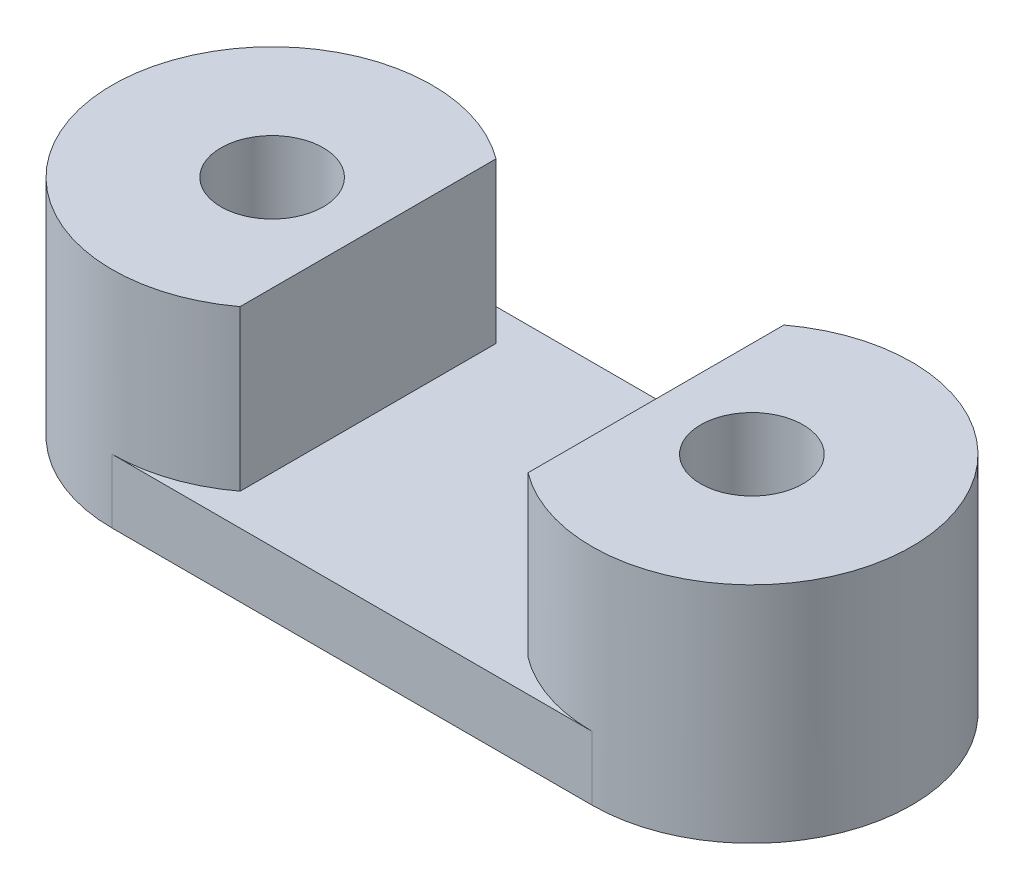
ISO-10303-21;
HEADER;
FILE_DESCRIPTION(('STEP AP214'),'2;1');
FILE_NAME('part.step','',(''),(''),'','','');
FILE_SCHEMA(('AUTOMOTIVE_DESIGN { 1 0 10303 214 1 1 1 1 }'));
ENDSEC;
DATA;
#1=APPLICATION_CONTEXT('core data for automotive mechanical design processes');
#2=APPLICATION_PROTOCOL_DEFINITION('international standard','automotive_design',2000,#1);
#3=PRODUCT_CONTEXT('',#1,'mechanical');
#4=PRODUCT('Part','Part','',(#3));
#5=PRODUCT_RELATED_PRODUCT_CATEGORY('part','',(#4));
#6=PRODUCT_DEFINITION_FORMATION('','',#4);
#7=PRODUCT_DEFINITION_CONTEXT('part definition',#1,'design');
#8=PRODUCT_DEFINITION('design','',#6,#7);
#9=PRODUCT_DEFINITION_SHAPE('','',#8);
#10=(LENGTH_UNIT() NAMED_UNIT(*) SI_UNIT(.MILLI.,.METRE.));
#11=(NAMED_UNIT(*) PLANE_ANGLE_UNIT() SI_UNIT($,.RADIAN.));
#12=(NAMED_UNIT(*) SI_UNIT($,.STERADIAN.) SOLID_ANGLE_UNIT());
#13=UNCERTAINTY_MEASURE_WITH_UNIT(LENGTH_MEASURE(1.E-05),#10,'distance_accuracy_value','');
#14=(GEOMETRIC_REPRESENTATION_CONTEXT(3) GLOBAL_UNCERTAINTY_ASSIGNED_CONTEXT((#13)) GLOBAL_UNIT_ASSIGNED_CONTEXT((#10,
#11,#12)) REPRESENTATION_CONTEXT('',''));
#15=CARTESIAN_POINT('',(0.,0.,0.));
#16=DIRECTION('',(0.,0.,1.));
#17=DIRECTION('',(1.,0.,0.));
#18=AXIS2_PLACEMENT_3D('',#15,#16,#17);
#19=CARTESIAN_POINT('',(-7.5,2.,0.));
#20=DIRECTION('',(0.,1.,0.));
#21=DIRECTION('',(0.,0.,1.));
#22=AXIS2_PLACEMENT_3D('',#19,#20,#21);
#23=PLANE('',#22);
#24=DIRECTION('',(-1.,0.,0.));
#25=VECTOR('',#24,1.);
#26=CARTESIAN_POINT('',(-7.5,2.,-5.));
#27=LINE('',#26,#25);
#28=CARTESIAN_POINT('',(7.5,2.,-5.));
#29=VERTEX_POINT('',#28);
#30=CARTESIAN_POINT('',(-7.5,2.,-5.));
#31=VERTEX_POINT('',#30);
#32=EDGE_CURVE('E147',#29,#31,#27,.T.);
#33=ORIENTED_EDGE('',*,*,#32,.T.);
#34=CARTESIAN_POINT('',(-7.5,2.,0.));
#35=DIRECTION('',(0.,1.,0.));
#36=DIRECTION('',(0.,0.,1.));
#37=AXIS2_PLACEMENT_3D('',#34,#35,#36);
#38=CIRCLE('',#37,5.);
#39=CARTESIAN_POINT('',(-4.5,2.,-4.));
#40=VERTEX_POINT('',#39);
#41=EDGE_CURVE('E36',#40,#31,#38,.T.);
#42=ORIENTED_EDGE('',*,*,#41,.F.);
#43=DIRECTION('',(0.,0.,1.));
#44=VECTOR('',#43,1.);
#45=CARTESIAN_POINT('',(-4.5,2.,-5.00005));
#46=LINE('',#45,#44);
#47=CARTESIAN_POINT('',(-4.5,2.,4.));
#48=VERTEX_POINT('',#47);
#49=EDGE_CURVE('E111',#40,#48,#46,.T.);
#50=ORIENTED_EDGE('',*,*,#49,.T.);
#51=CARTESIAN_POINT('',(-7.5,2.,5.));
#52=VERTEX_POINT('',#51);
#53=EDGE_CURVE('E130',#52,#48,#38,.T.);
#54=ORIENTED_EDGE('',*,*,#53,.F.);
#55=DIRECTION('',(1.,0.,0.));
#56=VECTOR('',#55,1.);
#57=CARTESIAN_POINT('',(-7.5,2.,5.));
#58=LINE('',#57,#56);
#59=CARTESIAN_POINT('',(7.5,2.,5.));
#60=VERTEX_POINT('',#59);
#61=EDGE_CURVE('E145',#52,#60,#58,.T.);
#62=ORIENTED_EDGE('',*,*,#61,.T.);
#63=CARTESIAN_POINT('',(7.5,2.,0.));
#64=DIRECTION('',(0.,1.,0.));
#65=DIRECTION('',(0.,0.,1.));
#66=AXIS2_PLACEMENT_3D('',#63,#64,#65);
#67=CIRCLE('',#66,5.);
#68=CARTESIAN_POINT('',(4.5,2.,4.));
#69=VERTEX_POINT('',#68);
#70=EDGE_CURVE('E110',#69,#60,#67,.T.);
#71=ORIENTED_EDGE('',*,*,#70,.F.);
#72=DIRECTION('',(0.,0.,1.));
#73=VECTOR('',#72,1.);
#74=CARTESIAN_POINT('',(4.5,2.,-5.00005));
#75=LINE('',#74,#73);
#76=CARTESIAN_POINT('',(4.5,2.,-4.));
#77=VERTEX_POINT('',#76);
#78=EDGE_CURVE('E99',#77,#69,#75,.T.);
#79=ORIENTED_EDGE('',*,*,#78,.F.);
#80=EDGE_CURVE('E108',#29,#77,#67,.T.);
#81=ORIENTED_EDGE('',*,*,#80,.F.);
#82=EDGE_LOOP('',(#33,#42,#50,#54,#62,#71,#79,#81));
#83=FACE_BOUND('',#82,.T.);
#84=ADVANCED_FACE('F32',(#83),#23,.T.);
#85=CARTESIAN_POINT('',(-7.5,0.,0.));
#86=DIRECTION('',(0.,1.,0.));
#87=DIRECTION('',(0.,0.,1.));
#88=AXIS2_PLACEMENT_3D('',#85,#86,#87);
#89=PLANE('',#88);
#90=CARTESIAN_POINT('',(-7.5,0.,0.));
#91=DIRECTION('',(0.,1.,0.));
#92=DIRECTION('',(0.,0.,1.));
#93=AXIS2_PLACEMENT_3D('',#90,#91,#92);
#94=CIRCLE('',#93,1.6);
#95=CARTESIAN_POINT('',(-7.5,0.,1.6));
#96=VERTEX_POINT('',#95);
#97=EDGE_CURVE('E174',#96,#96,#94,.T.);
#98=ORIENTED_EDGE('',*,*,#97,.T.);
#99=EDGE_LOOP('',(#98));
#100=FACE_BOUND('',#99,.T.);
#101=CARTESIAN_POINT('',(-7.5,0.,0.));
#102=DIRECTION('',(0.,1.,0.));
#103=DIRECTION('',(0.,0.,1.));
#104=AXIS2_PLACEMENT_3D('',#101,#102,#103);
#105=CIRCLE('',#104,5.);
#106=CARTESIAN_POINT('',(-7.5,0.,-5.));
#107=VERTEX_POINT('',#106);
#108=CARTESIAN_POINT('',(-7.5,0.,5.));
#109=VERTEX_POINT('',#108);
#110=EDGE_CURVE('E173',#107,#109,#105,.T.);
#111=ORIENTED_EDGE('',*,*,#110,.F.);
#112=DIRECTION('',(-1.,0.,0.));
#113=VECTOR('',#112,1.);
#114=CARTESIAN_POINT('',(-7.5,0.,-5.));
#115=LINE('',#114,#113);
#116=CARTESIAN_POINT('',(7.5,0.,-5.));
#117=VERTEX_POINT('',#116);
#118=EDGE_CURVE('E148',#117,#107,#115,.T.);
#119=ORIENTED_EDGE('',*,*,#118,.F.);
#120=CARTESIAN_POINT('',(7.5,0.,0.));
#121=DIRECTION('',(0.,1.,0.));
#122=DIRECTION('',(0.,0.,1.));
#123=AXIS2_PLACEMENT_3D('',#120,#121,#122);
#124=CIRCLE('',#123,5.);
#125=CARTESIAN_POINT('',(7.5,0.,5.));
#126=VERTEX_POINT('',#125);
#127=EDGE_CURVE('E169',#126,#117,#124,.T.);
#128=ORIENTED_EDGE('',*,*,#127,.F.);
#129=DIRECTION('',(1.,0.,0.));
#130=VECTOR('',#129,1.);
#131=CARTESIAN_POINT('',(-7.5,0.,5.));
#132=LINE('',#131,#130);
#133=EDGE_CURVE('E171',#109,#126,#132,.T.);
#134=ORIENTED_EDGE('',*,*,#133,.F.);
#135=EDGE_LOOP('',(#111,#119,#128,#134));
#136=FACE_BOUND('',#135,.T.);
#137=CARTESIAN_POINT('',(7.5,0.,0.));
#138=DIRECTION('',(0.,1.,0.));
#139=DIRECTION('',(0.,0.,1.));
#140=AXIS2_PLACEMENT_3D('',#137,#138,#139);
#141=CIRCLE('',#140,1.6);
#142=CARTESIAN_POINT('',(7.5,0.,1.6));
#143=VERTEX_POINT('',#142);
#144=EDGE_CURVE('E129',#143,#143,#141,.T.);
#145=ORIENTED_EDGE('',*,*,#144,.T.);
#146=EDGE_LOOP('',(#145));
#147=FACE_BOUND('',#146,.T.);
#148=ADVANCED_FACE('F181',(#100,#136,#147),#89,.F.);
#149=CARTESIAN_POINT('',(-7.5,2.,0.));
#150=DIRECTION('',(0.,-1.,0.));
#151=DIRECTION('',(0.,0.,-1.));
#152=AXIS2_PLACEMENT_3D('',#149,#150,#151);
#153=CYLINDRICAL_SURFACE('',#152,5.);
#154=CARTESIAN_POINT('',(-7.5,7.,0.));
#155=DIRECTION('',(0.,1.,0.));
#156=DIRECTION('',(0.,0.,1.));
#157=AXIS2_PLACEMENT_3D('',#154,#155,#156);
#158=CIRCLE('',#157,5.);
#159=CARTESIAN_POINT('',(-4.5,7.,-4.));
#160=VERTEX_POINT('',#159);
#161=CARTESIAN_POINT('',(-4.5,7.,4.));
#162=VERTEX_POINT('',#161);
#163=EDGE_CURVE('E126',#160,#162,#158,.T.);
#164=ORIENTED_EDGE('',*,*,#163,.F.);
#165=DIRECTION('',(0.,-1.,0.));
#166=VECTOR('',#165,1.);
#167=CARTESIAN_POINT('',(-4.5,2.,-4.));
#168=LINE('',#167,#166);
#169=EDGE_CURVE('E48',#160,#40,#168,.T.);
#170=ORIENTED_EDGE('',*,*,#169,.T.);
#171=ORIENTED_EDGE('',*,*,#41,.T.);
#172=DIRECTION('',(0.,-1.,0.));
#173=VECTOR('',#172,1.);
#174=CARTESIAN_POINT('',(-7.5,2.,-5.));
#175=LINE('',#174,#173);
#176=EDGE_CURVE('E152',#31,#107,#175,.T.);
#177=ORIENTED_EDGE('',*,*,#176,.T.);
#178=ORIENTED_EDGE('',*,*,#110,.T.);
#179=DIRECTION('',(0.,-1.,0.));
#180=VECTOR('',#179,1.);
#181=CARTESIAN_POINT('',(-7.5,2.,5.));
#182=LINE('',#181,#180);
#183=EDGE_CURVE('E139',#52,#109,#182,.T.);
#184=ORIENTED_EDGE('',*,*,#183,.F.);
#185=ORIENTED_EDGE('',*,*,#53,.T.);
#186=DIRECTION('',(0.,-1.,0.));
#187=VECTOR('',#186,1.);
#188=CARTESIAN_POINT('',(-4.5,2.,4.));
#189=LINE('',#188,#187);
#190=EDGE_CURVE('E192',#48,#162,#189,.F.);
#191=ORIENTED_EDGE('',*,*,#190,.T.);
#192=EDGE_LOOP('',(#164,#170,#171,#177,#178,#184,#185,#191));
#193=FACE_BOUND('',#192,.T.);
#194=ADVANCED_FACE('F34',(#193),#153,.T.);
#195=CARTESIAN_POINT('',(-7.5,2.,5.));
#196=DIRECTION('',(0.,0.,-1.));
#197=DIRECTION('',(-1.,0.,0.));
#198=AXIS2_PLACEMENT_3D('',#195,#196,#197);
#199=PLANE('',#198);
#200=ORIENTED_EDGE('',*,*,#133,.T.);
#201=DIRECTION('',(0.,-1.,0.));
#202=VECTOR('',#201,1.);
#203=CARTESIAN_POINT('',(7.5,2.,5.));
#204=LINE('',#203,#202);
#205=EDGE_CURVE('E137',#60,#126,#204,.T.);
#206=ORIENTED_EDGE('',*,*,#205,.F.);
#207=ORIENTED_EDGE('',*,*,#61,.F.);
#208=ORIENTED_EDGE('',*,*,#183,.T.);
#209=EDGE_LOOP('',(#200,#206,#207,#208));
#210=FACE_BOUND('',#209,.T.);
#211=ADVANCED_FACE('F205',(#210),#199,.F.);
#212=CARTESIAN_POINT('',(7.5,2.,0.));
#213=DIRECTION('',(0.,-1.,0.));
#214=DIRECTION('',(0.,0.,-1.));
#215=AXIS2_PLACEMENT_3D('',#212,#213,#214);
#216=CYLINDRICAL_SURFACE('',#215,5.);
#217=CARTESIAN_POINT('',(7.5,7.,0.));
#218=DIRECTION('',(0.,1.,0.));
#219=DIRECTION('',(0.,0.,1.));
#220=AXIS2_PLACEMENT_3D('',#217,#218,#219);
#221=CIRCLE('',#220,5.);
#222=CARTESIAN_POINT('',(4.5,7.,4.));
#223=VERTEX_POINT('',#222);
#224=CARTESIAN_POINT('',(4.5,7.,-4.));
#225=VERTEX_POINT('',#224);
#226=EDGE_CURVE('E117',#223,#225,#221,.T.);
#227=ORIENTED_EDGE('',*,*,#226,.F.);
#228=DIRECTION('',(0.,-1.,0.));
#229=VECTOR('',#228,1.);
#230=CARTESIAN_POINT('',(4.5,2.,4.));
#231=LINE('',#230,#229);
#232=EDGE_CURVE('E56',#223,#69,#231,.T.);
#233=ORIENTED_EDGE('',*,*,#232,.T.);
#234=ORIENTED_EDGE('',*,*,#70,.T.);
#235=ORIENTED_EDGE('',*,*,#205,.T.);
#236=ORIENTED_EDGE('',*,*,#127,.T.);
#237=DIRECTION('',(0.,-1.,0.));
#238=VECTOR('',#237,1.);
#239=CARTESIAN_POINT('',(7.5,2.,-5.));
#240=LINE('',#239,#238);
#241=EDGE_CURVE('E116',#29,#117,#240,.T.);
#242=ORIENTED_EDGE('',*,*,#241,.F.);
#243=ORIENTED_EDGE('',*,*,#80,.T.);
#244=DIRECTION('',(0.,-1.,0.));
#245=VECTOR('',#244,1.);
#246=CARTESIAN_POINT('',(4.5,2.,-4.));
#247=LINE('',#246,#245);
#248=EDGE_CURVE('E96',#77,#225,#247,.F.);
#249=ORIENTED_EDGE('',*,*,#248,.T.);
#250=EDGE_LOOP('',(#227,#233,#234,#235,#236,#242,#243,#249));
#251=FACE_BOUND('',#250,.T.);
#252=ADVANCED_FACE('F114',(#251),#216,.T.);
#253=CARTESIAN_POINT('',(-7.5,2.,-5.));
#254=DIRECTION('',(0.,0.,1.));
#255=DIRECTION('',(1.,0.,0.));
#256=AXIS2_PLACEMENT_3D('',#253,#254,#255);
#257=PLANE('',#256);
#258=ORIENTED_EDGE('',*,*,#118,.T.);
#259=ORIENTED_EDGE('',*,*,#176,.F.);
#260=ORIENTED_EDGE('',*,*,#32,.F.);
#261=ORIENTED_EDGE('',*,*,#241,.T.);
#262=EDGE_LOOP('',(#258,#259,#260,#261));
#263=FACE_BOUND('',#262,.T.);
#264=ADVANCED_FACE('F228',(#263),#257,.F.);
#265=CARTESIAN_POINT('',(-7.5,2.,0.));
#266=DIRECTION('',(0.,-1.,0.));
#267=DIRECTION('',(0.,0.,-1.));
#268=AXIS2_PLACEMENT_3D('',#265,#266,#267);
#269=CYLINDRICAL_SURFACE('',#268,1.6);
#270=ORIENTED_EDGE('',*,*,#97,.F.);
#271=EDGE_LOOP('',(#270));
#272=FACE_BOUND('',#271,.T.);
#273=CARTESIAN_POINT('',(-7.5,7.,0.));
#274=DIRECTION('',(0.,1.,0.));
#275=DIRECTION('',(0.,0.,1.));
#276=AXIS2_PLACEMENT_3D('',#273,#274,#275);
#277=CIRCLE('',#276,1.6);
#278=CARTESIAN_POINT('',(-7.5,7.,1.6));
#279=VERTEX_POINT('',#278);
#280=EDGE_CURVE('E119',#279,#279,#277,.T.);
#281=ORIENTED_EDGE('',*,*,#280,.T.);
#282=EDGE_LOOP('',(#281));
#283=FACE_BOUND('',#282,.T.);
#284=ADVANCED_FACE('F187',(#272,#283),#269,.F.);
#285=CARTESIAN_POINT('',(7.5,2.,0.));
#286=DIRECTION('',(0.,-1.,0.));
#287=DIRECTION('',(0.,0.,-1.));
#288=AXIS2_PLACEMENT_3D('',#285,#286,#287);
#289=CYLINDRICAL_SURFACE('',#288,1.6);
#290=ORIENTED_EDGE('',*,*,#144,.F.);
#291=EDGE_LOOP('',(#290));
#292=FACE_BOUND('',#291,.T.);
#293=CARTESIAN_POINT('',(7.5,7.,0.));
#294=DIRECTION('',(0.,1.,0.));
#295=DIRECTION('',(0.,0.,1.));
#296=AXIS2_PLACEMENT_3D('',#293,#294,#295);
#297=CIRCLE('',#296,1.6);
#298=CARTESIAN_POINT('',(7.5,7.,1.6));
#299=VERTEX_POINT('',#298);
#300=EDGE_CURVE('E121',#299,#299,#297,.T.);
#301=ORIENTED_EDGE('',*,*,#300,.T.);
#302=EDGE_LOOP('',(#301));
#303=FACE_BOUND('',#302,.T.);
#304=ADVANCED_FACE('F183',(#292,#303),#289,.F.);
#305=CARTESIAN_POINT('',(-7.5,7.,0.));
#306=DIRECTION('',(0.,1.,0.));
#307=DIRECTION('',(0.,0.,1.));
#308=AXIS2_PLACEMENT_3D('',#305,#306,#307);
#309=PLANE('',#308);
#310=DIRECTION('',(0.,0.,1.));
#311=VECTOR('',#310,1.);
#312=CARTESIAN_POINT('',(-4.5,7.,0.));
#313=LINE('',#312,#311);
#314=EDGE_CURVE('E11',#160,#162,#313,.T.);
#315=ORIENTED_EDGE('',*,*,#314,.F.);
#316=ORIENTED_EDGE('',*,*,#163,.T.);
#317=EDGE_LOOP('',(#315,#316));
#318=FACE_BOUND('',#317,.T.);
#319=ORIENTED_EDGE('',*,*,#280,.F.);
#320=EDGE_LOOP('',(#319));
#321=FACE_BOUND('',#320,.T.);
#322=ADVANCED_FACE('F186',(#318,#321),#309,.T.);
#323=CARTESIAN_POINT('',(7.5,7.,0.));
#324=DIRECTION('',(0.,1.,0.));
#325=DIRECTION('',(0.,0.,1.));
#326=AXIS2_PLACEMENT_3D('',#323,#324,#325);
#327=PLANE('',#326);
#328=DIRECTION('',(0.,0.,-1.));
#329=VECTOR('',#328,1.);
#330=CARTESIAN_POINT('',(4.5,7.,0.));
#331=LINE('',#330,#329);
#332=EDGE_CURVE('E42',#223,#225,#331,.T.);
#333=ORIENTED_EDGE('',*,*,#332,.F.);
#334=ORIENTED_EDGE('',*,*,#226,.T.);
#335=EDGE_LOOP('',(#333,#334));
#336=FACE_BOUND('',#335,.T.);
#337=ORIENTED_EDGE('',*,*,#300,.F.);
#338=EDGE_LOOP('',(#337));
#339=FACE_BOUND('',#338,.T.);
#340=ADVANCED_FACE('F208',(#336,#339),#327,.T.);
#341=CARTESIAN_POINT('',(4.5,2.,-5.00005));
#342=DIRECTION('',(1.,0.,0.));
#343=DIRECTION('',(0.,0.,-1.));
#344=AXIS2_PLACEMENT_3D('',#341,#342,#343);
#345=PLANE('',#344);
#346=ORIENTED_EDGE('',*,*,#332,.T.);
#347=ORIENTED_EDGE('',*,*,#248,.F.);
#348=ORIENTED_EDGE('',*,*,#78,.T.);
#349=ORIENTED_EDGE('',*,*,#232,.F.);
#350=EDGE_LOOP('',(#346,#347,#348,#349));
#351=FACE_BOUND('',#350,.T.);
#352=ADVANCED_FACE('F98',(#351),#345,.F.);
#353=CARTESIAN_POINT('',(-4.5,2.,-5.00005));
#354=DIRECTION('',(-1.,0.,0.));
#355=DIRECTION('',(0.,0.,1.));
#356=AXIS2_PLACEMENT_3D('',#353,#354,#355);
#357=PLANE('',#356);
#358=ORIENTED_EDGE('',*,*,#314,.T.);
#359=ORIENTED_EDGE('',*,*,#190,.F.);
#360=ORIENTED_EDGE('',*,*,#49,.F.);
#361=ORIENTED_EDGE('',*,*,#169,.F.);
#362=EDGE_LOOP('',(#358,#359,#360,#361));
#363=FACE_BOUND('',#362,.T.);
#364=ADVANCED_FACE('F215',(#363),#357,.F.);
#365=CLOSED_SHELL('',(#84,#148,#194,#211,#252,#264,#284,#304,#322,#340,#352,#364));
#366=MANIFOLD_SOLID_BREP('B2',#365);
#367=ADVANCED_BREP_SHAPE_REPRESENTATION('',(#18,#366),#14);
#368=SHAPE_DEFINITION_REPRESENTATION(#9,#367);
ENDSEC;
END-ISO-10303-21;
